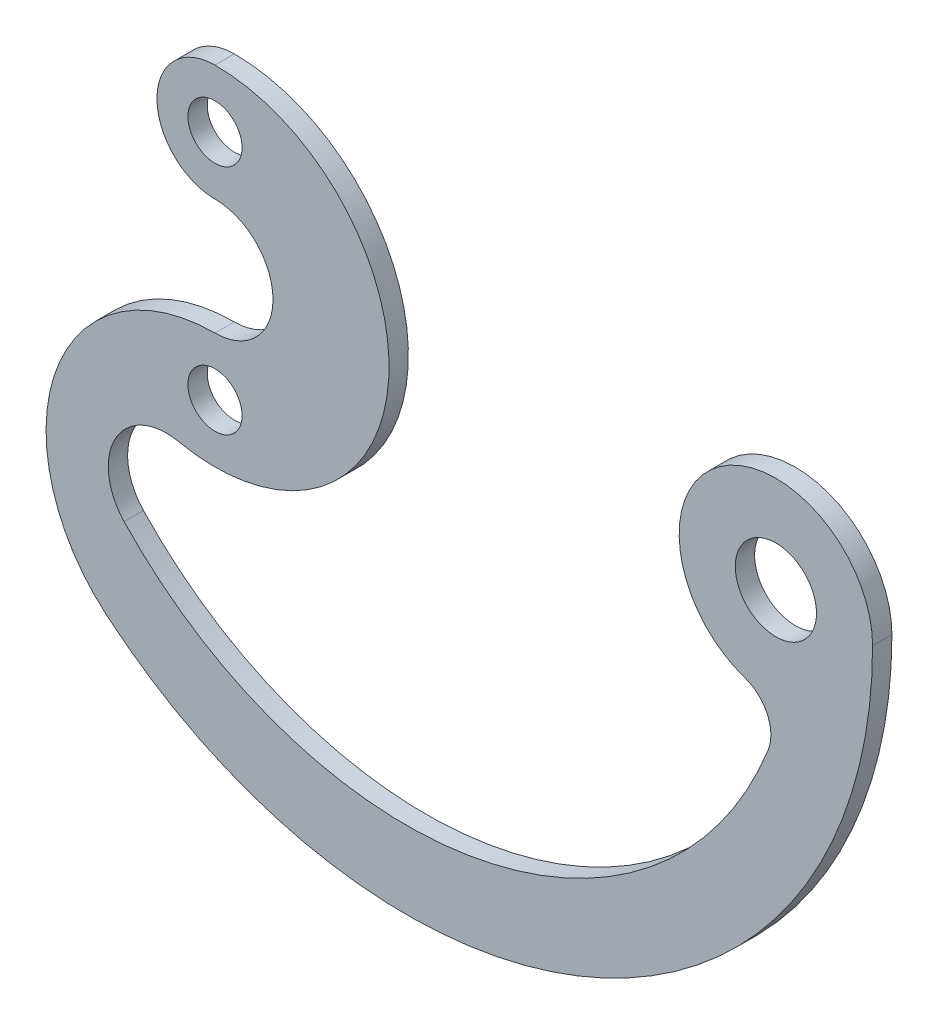
ISO-10303-21;
HEADER;
FILE_DESCRIPTION(('STEP AP214'),'2;1');
FILE_NAME('part.step','',(''),(''),'','','');
FILE_SCHEMA(('AUTOMOTIVE_DESIGN { 1 0 10303 214 1 1 1 1 }'));
ENDSEC;
DATA;
#1=APPLICATION_CONTEXT('core data for automotive mechanical design processes');
#2=APPLICATION_PROTOCOL_DEFINITION('international standard','automotive_design',2000,#1);
#3=PRODUCT_CONTEXT('',#1,'mechanical');
#4=PRODUCT('Part','Part','',(#3));
#5=PRODUCT_RELATED_PRODUCT_CATEGORY('part','',(#4));
#6=PRODUCT_DEFINITION_FORMATION('','',#4);
#7=PRODUCT_DEFINITION_CONTEXT('part definition',#1,'design');
#8=PRODUCT_DEFINITION('design','',#6,#7);
#9=PRODUCT_DEFINITION_SHAPE('','',#8);
#10=(LENGTH_UNIT() NAMED_UNIT(*) SI_UNIT(.MILLI.,.METRE.));
#11=(NAMED_UNIT(*) PLANE_ANGLE_UNIT() SI_UNIT($,.RADIAN.));
#12=(NAMED_UNIT(*) SI_UNIT($,.STERADIAN.) SOLID_ANGLE_UNIT());
#13=UNCERTAINTY_MEASURE_WITH_UNIT(LENGTH_MEASURE(1.E-05),#10,'distance_accuracy_value','');
#14=(GEOMETRIC_REPRESENTATION_CONTEXT(3) GLOBAL_UNCERTAINTY_ASSIGNED_CONTEXT((#13)) GLOBAL_UNIT_ASSIGNED_CONTEXT((#10,
#11,#12)) REPRESENTATION_CONTEXT('',''));
#15=CARTESIAN_POINT('',(0.,0.,0.));
#16=DIRECTION('',(0.,0.,1.));
#17=DIRECTION('',(1.,0.,0.));
#18=AXIS2_PLACEMENT_3D('',#15,#16,#17);
#19=CARTESIAN_POINT('',(0.,3.,1.));
#20=DIRECTION('',(0.,0.,1.));
#21=DIRECTION('',(1.,0.,0.));
#22=AXIS2_PLACEMENT_3D('',#19,#20,#21);
#23=PLANE('',#22);
#24=CARTESIAN_POINT('',(0.,-6.,1.));
#25=DIRECTION('',(0.,0.,1.));
#26=DIRECTION('',(1.,0.,0.));
#27=AXIS2_PLACEMENT_3D('',#24,#25,#26);
#28=CIRCLE('',#27,1.4);
#29=CARTESIAN_POINT('',(1.4,-6.,1.));
#30=VERTEX_POINT('',#29);
#31=EDGE_CURVE('E157',#30,#30,#28,.T.);
#32=ORIENTED_EDGE('',*,*,#31,.F.);
#33=EDGE_LOOP('',(#32));
#34=FACE_BOUND('',#33,.T.);
#35=CARTESIAN_POINT('',(0.,6.,1.));
#36=DIRECTION('',(0.,0.,1.));
#37=DIRECTION('',(1.,0.,0.));
#38=AXIS2_PLACEMENT_3D('',#35,#36,#37);
#39=CIRCLE('',#38,3.);
#40=CARTESIAN_POINT('',(0.,9.,1.));
#41=VERTEX_POINT('',#40);
#42=CARTESIAN_POINT('',(0.,3.,1.));
#43=VERTEX_POINT('',#42);
#44=EDGE_CURVE('E158',#41,#43,#39,.T.);
#45=ORIENTED_EDGE('',*,*,#44,.T.);
#46=CARTESIAN_POINT('',(0.,0.,1.));
#47=DIRECTION('',(0.,0.,-1.));
#48=DIRECTION('',(1.,0.,0.));
#49=AXIS2_PLACEMENT_3D('',#46,#47,#48);
#50=CIRCLE('',#49,3.);
#51=CARTESIAN_POINT('',(0.,-3.,1.));
#52=VERTEX_POINT('',#51);
#53=EDGE_CURVE('E98',#43,#52,#50,.T.);
#54=ORIENTED_EDGE('',*,*,#53,.T.);
#55=CARTESIAN_POINT('',(0.,-11.732954320244,1.));
#56=DIRECTION('',(0.,0.,1.));
#57=DIRECTION('',(1.,0.,0.));
#58=AXIS2_PLACEMENT_3D('',#55,#56,#57);
#59=CIRCLE('',#58,8.73295432024402);
#60=CARTESIAN_POINT('',(-5.63484885049802,-18.4047583934696,1.));
#61=VERTEX_POINT('',#60);
#62=EDGE_CURVE('E170',#52,#61,#59,.T.);
#63=ORIENTED_EDGE('',*,*,#62,.T.);
#64=CARTESIAN_POINT('',(9.90937734962726,0.,1.));
#65=DIRECTION('',(0.,0.,1.));
#66=DIRECTION('',(1.,0.,0.));
#67=AXIS2_PLACEMENT_3D('',#64,#65,#66);
#68=CIRCLE('',#67,24.0906226503727);
#69=CARTESIAN_POINT('',(34.,0.,1.));
#70=VERTEX_POINT('',#69);
#71=EDGE_CURVE('E172',#61,#70,#68,.T.);
#72=ORIENTED_EDGE('',*,*,#71,.T.);
#73=CARTESIAN_POINT('',(29.,0.,1.));
#74=DIRECTION('',(0.,0.,1.));
#75=DIRECTION('',(1.,0.,0.));
#76=AXIS2_PLACEMENT_3D('',#73,#74,#75);
#77=CIRCLE('',#76,5.);
#78=CARTESIAN_POINT('',(27.3877416288338,-4.73292963655753,1.));
#79=VERTEX_POINT('',#78);
#80=EDGE_CURVE('E175',#70,#79,#77,.T.);
#81=ORIENTED_EDGE('',*,*,#80,.T.);
#82=CARTESIAN_POINT('',(26.7428382803674,-6.62610149118055,1.));
#83=DIRECTION('',(0.,0.,-1.));
#84=DIRECTION('',(-1.,0.,0.));
#85=AXIS2_PLACEMENT_3D('',#82,#83,#84);
#86=CIRCLE('',#85,2.);
#87=CARTESIAN_POINT('',(28.6038533770914,-7.35864692305865,1.));
#88=VERTEX_POINT('',#87);
#89=EDGE_CURVE('E120',#79,#88,#86,.T.);
#90=ORIENTED_EDGE('',*,*,#89,.T.);
#91=CARTESIAN_POINT('',(9.90937734962726,0.,1.));
#92=DIRECTION('',(0.,0.,-1.));
#93=DIRECTION('',(1.,0.,0.));
#94=AXIS2_PLACEMENT_3D('',#91,#92,#93);
#95=CIRCLE('',#94,20.0906226503727);
#96=CARTESIAN_POINT('',(-4.6988446892208,-13.7924967769938,1.));
#97=VERTEX_POINT('',#96);
#98=EDGE_CURVE('E114',#88,#97,#95,.T.);
#99=ORIENTED_EDGE('',*,*,#98,.T.);
#100=CARTESIAN_POINT('',(-2.51749536624542,-11.732954320244,1.));
#101=DIRECTION('',(0.,0.,-1.));
#102=DIRECTION('',(1.,0.,0.));
#103=AXIS2_PLACEMENT_3D('',#100,#101,#102);
#104=CIRCLE('',#103,3.);
#105=CARTESIAN_POINT('',(-1.88812152468407,-8.79971574018301,1.));
#106=VERTEX_POINT('',#105);
#107=EDGE_CURVE('E118',#97,#106,#104,.T.);
#108=ORIENTED_EDGE('',*,*,#107,.T.);
#109=CARTESIAN_POINT('',(0.,0.,1.));
#110=DIRECTION('',(0.,0.,1.));
#111=DIRECTION('',(1.,0.,0.));
#112=AXIS2_PLACEMENT_3D('',#109,#110,#111);
#113=CIRCLE('',#112,9.);
#114=EDGE_CURVE('E52',#106,#41,#113,.T.);
#115=ORIENTED_EDGE('',*,*,#114,.T.);
#116=EDGE_LOOP('',(#45,#54,#63,#72,#81,#90,#99,#108,#115));
#117=FACE_BOUND('',#116,.T.);
#118=CARTESIAN_POINT('',(0.,6.,1.));
#119=DIRECTION('',(0.,0.,1.));
#120=DIRECTION('',(1.,0.,0.));
#121=AXIS2_PLACEMENT_3D('',#118,#119,#120);
#122=CIRCLE('',#121,1.4);
#123=CARTESIAN_POINT('',(1.4,6.,1.));
#124=VERTEX_POINT('',#123);
#125=EDGE_CURVE('E146',#124,#124,#122,.T.);
#126=ORIENTED_EDGE('',*,*,#125,.F.);
#127=EDGE_LOOP('',(#126));
#128=FACE_BOUND('',#127,.T.);
#129=CARTESIAN_POINT('',(29.,0.,1.));
#130=DIRECTION('',(0.,0.,1.));
#131=DIRECTION('',(1.,0.,0.));
#132=AXIS2_PLACEMENT_3D('',#129,#130,#131);
#133=CIRCLE('',#132,2.1);
#134=CARTESIAN_POINT('',(31.1,0.,1.));
#135=VERTEX_POINT('',#134);
#136=EDGE_CURVE('E353',#135,#135,#133,.T.);
#137=ORIENTED_EDGE('',*,*,#136,.F.);
#138=EDGE_LOOP('',(#137));
#139=FACE_BOUND('',#138,.T.);
#140=ADVANCED_FACE('F35',(#34,#117,#128,#139),#23,.T.);
#141=CARTESIAN_POINT('',(0.,3.,0.));
#142=DIRECTION('',(0.,0.,1.));
#143=DIRECTION('',(1.,0.,0.));
#144=AXIS2_PLACEMENT_3D('',#141,#142,#143);
#145=PLANE('',#144);
#146=CARTESIAN_POINT('',(0.,6.,0.));
#147=DIRECTION('',(0.,0.,1.));
#148=DIRECTION('',(1.,0.,0.));
#149=AXIS2_PLACEMENT_3D('',#146,#147,#148);
#150=CIRCLE('',#149,3.);
#151=CARTESIAN_POINT('',(0.,9.,0.));
#152=VERTEX_POINT('',#151);
#153=CARTESIAN_POINT('',(0.,3.,0.));
#154=VERTEX_POINT('',#153);
#155=EDGE_CURVE('E151',#152,#154,#150,.T.);
#156=ORIENTED_EDGE('',*,*,#155,.F.);
#157=CARTESIAN_POINT('',(0.,0.,0.));
#158=DIRECTION('',(0.,0.,1.));
#159=DIRECTION('',(1.,0.,0.));
#160=AXIS2_PLACEMENT_3D('',#157,#158,#159);
#161=CIRCLE('',#160,9.);
#162=CARTESIAN_POINT('',(-1.88812152468407,-8.79971574018301,0.));
#163=VERTEX_POINT('',#162);
#164=EDGE_CURVE('E90',#163,#152,#161,.T.);
#165=ORIENTED_EDGE('',*,*,#164,.F.);
#166=CARTESIAN_POINT('',(-2.51749536624542,-11.732954320244,0.));
#167=DIRECTION('',(0.,0.,-1.));
#168=DIRECTION('',(1.,0.,0.));
#169=AXIS2_PLACEMENT_3D('',#166,#167,#168);
#170=CIRCLE('',#169,3.);
#171=CARTESIAN_POINT('',(-4.6988446892208,-13.7924967769938,0.));
#172=VERTEX_POINT('',#171);
#173=EDGE_CURVE('E84',#172,#163,#170,.T.);
#174=ORIENTED_EDGE('',*,*,#173,.F.);
#175=CARTESIAN_POINT('',(9.90937734962726,0.,0.));
#176=DIRECTION('',(0.,0.,-1.));
#177=DIRECTION('',(1.,0.,0.));
#178=AXIS2_PLACEMENT_3D('',#175,#176,#177);
#179=CIRCLE('',#178,20.0906226503727);
#180=CARTESIAN_POINT('',(28.6038533770914,-7.35864692305865,0.));
#181=VERTEX_POINT('',#180);
#182=EDGE_CURVE('E128',#181,#172,#179,.T.);
#183=ORIENTED_EDGE('',*,*,#182,.F.);
#184=CARTESIAN_POINT('',(26.7428382803674,-6.62610149118055,0.));
#185=DIRECTION('',(0.,0.,-1.));
#186=DIRECTION('',(-1.,0.,0.));
#187=AXIS2_PLACEMENT_3D('',#184,#185,#186);
#188=CIRCLE('',#187,2.);
#189=CARTESIAN_POINT('',(27.3877416288338,-4.73292963655753,0.));
#190=VERTEX_POINT('',#189);
#191=EDGE_CURVE('E194',#190,#181,#188,.T.);
#192=ORIENTED_EDGE('',*,*,#191,.F.);
#193=CARTESIAN_POINT('',(29.,0.,0.));
#194=DIRECTION('',(0.,0.,1.));
#195=DIRECTION('',(1.,0.,0.));
#196=AXIS2_PLACEMENT_3D('',#193,#194,#195);
#197=CIRCLE('',#196,5.);
#198=CARTESIAN_POINT('',(34.,0.,0.));
#199=VERTEX_POINT('',#198);
#200=EDGE_CURVE('E188',#199,#190,#197,.T.);
#201=ORIENTED_EDGE('',*,*,#200,.F.);
#202=CARTESIAN_POINT('',(9.90937734962726,0.,0.));
#203=DIRECTION('',(0.,0.,1.));
#204=DIRECTION('',(1.,0.,0.));
#205=AXIS2_PLACEMENT_3D('',#202,#203,#204);
#206=CIRCLE('',#205,24.0906226503727);
#207=CARTESIAN_POINT('',(-5.63484885049802,-18.4047583934696,0.));
#208=VERTEX_POINT('',#207);
#209=EDGE_CURVE('E214',#208,#199,#206,.T.);
#210=ORIENTED_EDGE('',*,*,#209,.F.);
#211=CARTESIAN_POINT('',(0.,-11.732954320244,0.));
#212=DIRECTION('',(0.,0.,1.));
#213=DIRECTION('',(1.,0.,0.));
#214=AXIS2_PLACEMENT_3D('',#211,#212,#213);
#215=CIRCLE('',#214,8.73295432024402);
#216=CARTESIAN_POINT('',(0.,-3.,0.));
#217=VERTEX_POINT('',#216);
#218=EDGE_CURVE('E207',#217,#208,#215,.T.);
#219=ORIENTED_EDGE('',*,*,#218,.F.);
#220=CARTESIAN_POINT('',(0.,0.,0.));
#221=DIRECTION('',(0.,0.,-1.));
#222=DIRECTION('',(1.,0.,0.));
#223=AXIS2_PLACEMENT_3D('',#220,#221,#222);
#224=CIRCLE('',#223,3.);
#225=EDGE_CURVE('E213',#154,#217,#224,.T.);
#226=ORIENTED_EDGE('',*,*,#225,.F.);
#227=EDGE_LOOP('',(#156,#165,#174,#183,#192,#201,#210,#219,#226));
#228=FACE_BOUND('',#227,.T.);
#229=CARTESIAN_POINT('',(0.,6.,0.));
#230=DIRECTION('',(0.,0.,1.));
#231=DIRECTION('',(1.,0.,0.));
#232=AXIS2_PLACEMENT_3D('',#229,#230,#231);
#233=CIRCLE('',#232,1.4);
#234=CARTESIAN_POINT('',(1.4,6.,0.));
#235=VERTEX_POINT('',#234);
#236=EDGE_CURVE('E152',#235,#235,#233,.T.);
#237=ORIENTED_EDGE('',*,*,#236,.T.);
#238=EDGE_LOOP('',(#237));
#239=FACE_BOUND('',#238,.T.);
#240=CARTESIAN_POINT('',(0.,-6.,0.));
#241=DIRECTION('',(0.,0.,1.));
#242=DIRECTION('',(1.,0.,0.));
#243=AXIS2_PLACEMENT_3D('',#240,#241,#242);
#244=CIRCLE('',#243,1.4);
#245=CARTESIAN_POINT('',(1.4,-6.,0.));
#246=VERTEX_POINT('',#245);
#247=EDGE_CURVE('E153',#246,#246,#244,.T.);
#248=ORIENTED_EDGE('',*,*,#247,.T.);
#249=EDGE_LOOP('',(#248));
#250=FACE_BOUND('',#249,.T.);
#251=CARTESIAN_POINT('',(29.,0.,0.));
#252=DIRECTION('',(0.,0.,1.));
#253=DIRECTION('',(1.,0.,0.));
#254=AXIS2_PLACEMENT_3D('',#251,#252,#253);
#255=CIRCLE('',#254,2.1);
#256=CARTESIAN_POINT('',(31.1,0.,0.));
#257=VERTEX_POINT('',#256);
#258=EDGE_CURVE('E356',#257,#257,#255,.T.);
#259=ORIENTED_EDGE('',*,*,#258,.T.);
#260=EDGE_LOOP('',(#259));
#261=FACE_BOUND('',#260,.T.);
#262=ADVANCED_FACE('F211',(#228,#239,#250,#261),#145,.F.);
#263=CARTESIAN_POINT('',(0.,6.,1.));
#264=DIRECTION('',(0.,0.,-1.));
#265=DIRECTION('',(-1.,0.,0.));
#266=AXIS2_PLACEMENT_3D('',#263,#264,#265);
#267=CYLINDRICAL_SURFACE('',#266,3.);
#268=ORIENTED_EDGE('',*,*,#155,.T.);
#269=DIRECTION('',(0.,0.,-1.));
#270=VECTOR('',#269,1.);
#271=CARTESIAN_POINT('',(0.,3.,1.));
#272=LINE('',#271,#270);
#273=EDGE_CURVE('E12',#43,#154,#272,.T.);
#274=ORIENTED_EDGE('',*,*,#273,.F.);
#275=ORIENTED_EDGE('',*,*,#44,.F.);
#276=DIRECTION('',(0.,0.,-1.));
#277=VECTOR('',#276,1.);
#278=CARTESIAN_POINT('',(0.,9.,1.));
#279=LINE('',#278,#277);
#280=EDGE_CURVE('E134',#41,#152,#279,.T.);
#281=ORIENTED_EDGE('',*,*,#280,.T.);
#282=EDGE_LOOP('',(#268,#274,#275,#281));
#283=FACE_BOUND('',#282,.T.);
#284=ADVANCED_FACE('F37',(#283),#267,.T.);
#285=CARTESIAN_POINT('',(0.,0.,1.));
#286=DIRECTION('',(0.,0.,-1.));
#287=DIRECTION('',(-1.,0.,0.));
#288=AXIS2_PLACEMENT_3D('',#285,#286,#287);
#289=CYLINDRICAL_SURFACE('',#288,3.);
#290=ORIENTED_EDGE('',*,*,#225,.T.);
#291=DIRECTION('',(0.,0.,-1.));
#292=VECTOR('',#291,1.);
#293=CARTESIAN_POINT('',(0.,-3.,1.));
#294=LINE('',#293,#292);
#295=EDGE_CURVE('E44',#52,#217,#294,.T.);
#296=ORIENTED_EDGE('',*,*,#295,.F.);
#297=ORIENTED_EDGE('',*,*,#53,.F.);
#298=ORIENTED_EDGE('',*,*,#273,.T.);
#299=EDGE_LOOP('',(#290,#296,#297,#298));
#300=FACE_BOUND('',#299,.T.);
#301=ADVANCED_FACE('F238',(#300),#289,.F.);
#302=CARTESIAN_POINT('',(0.,-11.732954320244,1.));
#303=DIRECTION('',(0.,0.,-1.));
#304=DIRECTION('',(-1.,0.,0.));
#305=AXIS2_PLACEMENT_3D('',#302,#303,#304);
#306=CYLINDRICAL_SURFACE('',#305,8.73295432024402);
#307=ORIENTED_EDGE('',*,*,#218,.T.);
#308=DIRECTION('',(0.,0.,-1.));
#309=VECTOR('',#308,1.);
#310=CARTESIAN_POINT('',(-5.63484885049802,-18.4047583934696,1.));
#311=LINE('',#310,#309);
#312=EDGE_CURVE('E199',#61,#208,#311,.T.);
#313=ORIENTED_EDGE('',*,*,#312,.F.);
#314=ORIENTED_EDGE('',*,*,#62,.F.);
#315=ORIENTED_EDGE('',*,*,#295,.T.);
#316=EDGE_LOOP('',(#307,#313,#314,#315));
#317=FACE_BOUND('',#316,.T.);
#318=ADVANCED_FACE('F205',(#317),#306,.T.);
#319=CARTESIAN_POINT('',(9.90937734962726,0.,1.));
#320=DIRECTION('',(0.,0.,-1.));
#321=DIRECTION('',(-1.,0.,0.));
#322=AXIS2_PLACEMENT_3D('',#319,#320,#321);
#323=CYLINDRICAL_SURFACE('',#322,24.0906226503727);
#324=ORIENTED_EDGE('',*,*,#209,.T.);
#325=DIRECTION('',(0.,0.,-1.));
#326=VECTOR('',#325,1.);
#327=CARTESIAN_POINT('',(34.,0.,1.));
#328=LINE('',#327,#326);
#329=EDGE_CURVE('E191',#70,#199,#328,.T.);
#330=ORIENTED_EDGE('',*,*,#329,.F.);
#331=ORIENTED_EDGE('',*,*,#71,.F.);
#332=ORIENTED_EDGE('',*,*,#312,.T.);
#333=EDGE_LOOP('',(#324,#330,#331,#332));
#334=FACE_BOUND('',#333,.T.);
#335=ADVANCED_FACE('F230',(#334),#323,.T.);
#336=CARTESIAN_POINT('',(29.,0.,1.));
#337=DIRECTION('',(0.,0.,-1.));
#338=DIRECTION('',(-1.,0.,0.));
#339=AXIS2_PLACEMENT_3D('',#336,#337,#338);
#340=CYLINDRICAL_SURFACE('',#339,5.);
#341=ORIENTED_EDGE('',*,*,#200,.T.);
#342=DIRECTION('',(0.,0.,-1.));
#343=VECTOR('',#342,1.);
#344=CARTESIAN_POINT('',(27.3877416288338,-4.73292963655753,1.));
#345=LINE('',#344,#343);
#346=EDGE_CURVE('E185',#79,#190,#345,.T.);
#347=ORIENTED_EDGE('',*,*,#346,.F.);
#348=ORIENTED_EDGE('',*,*,#80,.F.);
#349=ORIENTED_EDGE('',*,*,#329,.T.);
#350=EDGE_LOOP('',(#341,#347,#348,#349));
#351=FACE_BOUND('',#350,.T.);
#352=ADVANCED_FACE('F186',(#351),#340,.T.);
#353=CARTESIAN_POINT('',(26.7428382803674,-6.62610149118055,1.));
#354=DIRECTION('',(0.,0.,-1.));
#355=DIRECTION('',(-1.,0.,0.));
#356=AXIS2_PLACEMENT_3D('',#353,#354,#355);
#357=CYLINDRICAL_SURFACE('',#356,2.);
#358=ORIENTED_EDGE('',*,*,#191,.T.);
#359=DIRECTION('',(0.,0.,-1.));
#360=VECTOR('',#359,1.);
#361=CARTESIAN_POINT('',(28.6038533770914,-7.35864692305865,1.));
#362=LINE('',#361,#360);
#363=EDGE_CURVE('E129',#88,#181,#362,.T.);
#364=ORIENTED_EDGE('',*,*,#363,.F.);
#365=ORIENTED_EDGE('',*,*,#89,.F.);
#366=ORIENTED_EDGE('',*,*,#346,.T.);
#367=EDGE_LOOP('',(#358,#364,#365,#366));
#368=FACE_BOUND('',#367,.T.);
#369=ADVANCED_FACE('F193',(#368),#357,.F.);
#370=CARTESIAN_POINT('',(9.90937734962726,0.,1.));
#371=DIRECTION('',(0.,0.,-1.));
#372=DIRECTION('',(-1.,0.,0.));
#373=AXIS2_PLACEMENT_3D('',#370,#371,#372);
#374=CYLINDRICAL_SURFACE('',#373,20.0906226503727);
#375=ORIENTED_EDGE('',*,*,#182,.T.);
#376=DIRECTION('',(0.,0.,-1.));
#377=VECTOR('',#376,1.);
#378=CARTESIAN_POINT('',(-4.6988446892208,-13.7924967769938,1.));
#379=LINE('',#378,#377);
#380=EDGE_CURVE('E125',#97,#172,#379,.T.);
#381=ORIENTED_EDGE('',*,*,#380,.F.);
#382=ORIENTED_EDGE('',*,*,#98,.F.);
#383=ORIENTED_EDGE('',*,*,#363,.T.);
#384=EDGE_LOOP('',(#375,#381,#382,#383));
#385=FACE_BOUND('',#384,.T.);
#386=ADVANCED_FACE('F126',(#385),#374,.F.);
#387=CARTESIAN_POINT('',(-2.51749536624542,-11.732954320244,1.));
#388=DIRECTION('',(0.,0.,-1.));
#389=DIRECTION('',(-1.,0.,0.));
#390=AXIS2_PLACEMENT_3D('',#387,#388,#389);
#391=CYLINDRICAL_SURFACE('',#390,3.);
#392=ORIENTED_EDGE('',*,*,#173,.T.);
#393=DIRECTION('',(0.,0.,-1.));
#394=VECTOR('',#393,1.);
#395=CARTESIAN_POINT('',(-1.88812152468407,-8.79971574018301,1.));
#396=LINE('',#395,#394);
#397=EDGE_CURVE('E130',#106,#163,#396,.T.);
#398=ORIENTED_EDGE('',*,*,#397,.F.);
#399=ORIENTED_EDGE('',*,*,#107,.F.);
#400=ORIENTED_EDGE('',*,*,#380,.T.);
#401=EDGE_LOOP('',(#392,#398,#399,#400));
#402=FACE_BOUND('',#401,.T.);
#403=ADVANCED_FACE('F132',(#402),#391,.F.);
#404=CARTESIAN_POINT('',(0.,0.,1.));
#405=DIRECTION('',(0.,0.,-1.));
#406=DIRECTION('',(-1.,0.,0.));
#407=AXIS2_PLACEMENT_3D('',#404,#405,#406);
#408=CYLINDRICAL_SURFACE('',#407,9.);
#409=ORIENTED_EDGE('',*,*,#164,.T.);
#410=ORIENTED_EDGE('',*,*,#280,.F.);
#411=ORIENTED_EDGE('',*,*,#114,.F.);
#412=ORIENTED_EDGE('',*,*,#397,.T.);
#413=EDGE_LOOP('',(#409,#410,#411,#412));
#414=FACE_BOUND('',#413,.T.);
#415=ADVANCED_FACE('F224',(#414),#408,.T.);
#416=CARTESIAN_POINT('',(0.,6.,1.));
#417=DIRECTION('',(0.,0.,-1.));
#418=DIRECTION('',(-1.,0.,0.));
#419=AXIS2_PLACEMENT_3D('',#416,#417,#418);
#420=CYLINDRICAL_SURFACE('',#419,1.4);
#421=ORIENTED_EDGE('',*,*,#125,.T.);
#422=EDGE_LOOP('',(#421));
#423=FACE_BOUND('',#422,.T.);
#424=ORIENTED_EDGE('',*,*,#236,.F.);
#425=EDGE_LOOP('',(#424));
#426=FACE_BOUND('',#425,.T.);
#427=ADVANCED_FACE('F249',(#423,#426),#420,.F.);
#428=CARTESIAN_POINT('',(0.,-6.,1.));
#429=DIRECTION('',(0.,0.,-1.));
#430=DIRECTION('',(-1.,0.,0.));
#431=AXIS2_PLACEMENT_3D('',#428,#429,#430);
#432=CYLINDRICAL_SURFACE('',#431,1.4);
#433=ORIENTED_EDGE('',*,*,#31,.T.);
#434=EDGE_LOOP('',(#433));
#435=FACE_BOUND('',#434,.T.);
#436=ORIENTED_EDGE('',*,*,#247,.F.);
#437=EDGE_LOOP('',(#436));
#438=FACE_BOUND('',#437,.T.);
#439=ADVANCED_FACE('F281',(#435,#438),#432,.F.);
#440=CARTESIAN_POINT('',(29.,0.,1.));
#441=DIRECTION('',(0.,0.,-1.));
#442=DIRECTION('',(-1.,0.,0.));
#443=AXIS2_PLACEMENT_3D('',#440,#441,#442);
#444=CYLINDRICAL_SURFACE('',#443,2.1);
#445=ORIENTED_EDGE('',*,*,#136,.T.);
#446=EDGE_LOOP('',(#445));
#447=FACE_BOUND('',#446,.T.);
#448=ORIENTED_EDGE('',*,*,#258,.F.);
#449=EDGE_LOOP('',(#448));
#450=FACE_BOUND('',#449,.T.);
#451=ADVANCED_FACE('F288',(#447,#450),#444,.F.);
#452=CLOSED_SHELL('',(#140,#262,#284,#301,#318,#335,#352,#369,#386,#403,#415,#427,#439,#451));
#453=MANIFOLD_SOLID_BREP('B2',#452);
#454=ADVANCED_BREP_SHAPE_REPRESENTATION('',(#18,#453),#14);
#455=SHAPE_DEFINITION_REPRESENTATION(#9,#454);
ENDSEC;
END-ISO-10303-21;
